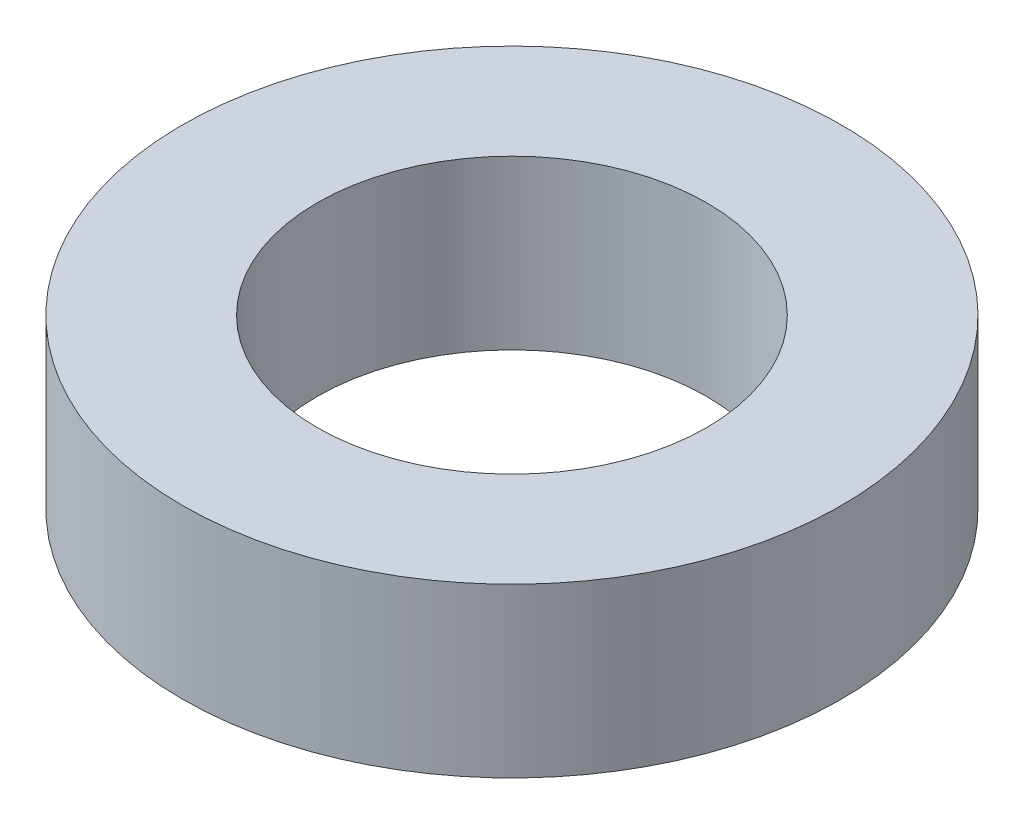
ISO-10303-21;
HEADER;
FILE_DESCRIPTION(('STEP AP214'),'2;1');
FILE_NAME('part.step','',(''),(''),'','','');
FILE_SCHEMA(('AUTOMOTIVE_DESIGN { 1 0 10303 214 1 1 1 1 }'));
ENDSEC;
DATA;
#1=APPLICATION_CONTEXT('core data for automotive mechanical design processes');
#2=APPLICATION_PROTOCOL_DEFINITION('international standard','automotive_design',2000,#1);
#3=PRODUCT_CONTEXT('',#1,'mechanical');
#4=PRODUCT('Part','Part','',(#3));
#5=PRODUCT_RELATED_PRODUCT_CATEGORY('part','',(#4));
#6=PRODUCT_DEFINITION_FORMATION('','',#4);
#7=PRODUCT_DEFINITION_CONTEXT('part definition',#1,'design');
#8=PRODUCT_DEFINITION('design','',#6,#7);
#9=PRODUCT_DEFINITION_SHAPE('','',#8);
#10=(LENGTH_UNIT() NAMED_UNIT(*) SI_UNIT(.MILLI.,.METRE.));
#11=(NAMED_UNIT(*) PLANE_ANGLE_UNIT() SI_UNIT($,.RADIAN.));
#12=(NAMED_UNIT(*) SI_UNIT($,.STERADIAN.) SOLID_ANGLE_UNIT());
#13=UNCERTAINTY_MEASURE_WITH_UNIT(LENGTH_MEASURE(1.E-05),#10,'distance_accuracy_value','');
#14=(GEOMETRIC_REPRESENTATION_CONTEXT(3) GLOBAL_UNCERTAINTY_ASSIGNED_CONTEXT((#13)) GLOBAL_UNIT_ASSIGNED_CONTEXT((#10,
#11,#12)) REPRESENTATION_CONTEXT('',''));
#15=CARTESIAN_POINT('',(0.,0.,0.));
#16=DIRECTION('',(0.,0.,1.));
#17=DIRECTION('',(1.,0.,0.));
#18=AXIS2_PLACEMENT_3D('',#15,#16,#17);
#19=CARTESIAN_POINT('',(0.,28.,0.));
#20=DIRECTION('',(0.,-1.,0.));
#21=DIRECTION('',(0.,0.,-1.));
#22=AXIS2_PLACEMENT_3D('',#19,#20,#21);
#23=CYLINDRICAL_SURFACE('',#22,55.);
#24=CARTESIAN_POINT('',(0.,28.,0.));
#25=DIRECTION('',(0.,1.,0.));
#26=DIRECTION('',(0.,0.,1.));
#27=AXIS2_PLACEMENT_3D('',#24,#25,#26);
#28=CIRCLE('',#27,55.);
#29=CARTESIAN_POINT('',(0.,28.,55.));
#30=VERTEX_POINT('',#29);
#31=EDGE_CURVE('E10',#30,#30,#28,.T.);
#32=ORIENTED_EDGE('',*,*,#31,.F.);
#33=EDGE_LOOP('',(#32));
#34=FACE_BOUND('',#33,.T.);
#35=CARTESIAN_POINT('',(0.,0.,0.));
#36=DIRECTION('',(0.,1.,0.));
#37=DIRECTION('',(0.,0.,1.));
#38=AXIS2_PLACEMENT_3D('',#35,#36,#37);
#39=CIRCLE('',#38,55.);
#40=CARTESIAN_POINT('',(0.,0.,55.));
#41=VERTEX_POINT('',#40);
#42=EDGE_CURVE('E37',#41,#41,#39,.T.);
#43=ORIENTED_EDGE('',*,*,#42,.T.);
#44=EDGE_LOOP('',(#43));
#45=FACE_BOUND('',#44,.T.);
#46=ADVANCED_FACE('F40',(#34,#45),#23,.T.);
#47=CARTESIAN_POINT('',(0.,28.,0.));
#48=DIRECTION('',(0.,1.,0.));
#49=DIRECTION('',(0.,0.,1.));
#50=AXIS2_PLACEMENT_3D('',#47,#48,#49);
#51=PLANE('',#50);
#52=CARTESIAN_POINT('',(0.,28.,0.));
#53=DIRECTION('',(0.,1.,0.));
#54=DIRECTION('',(0.,0.,1.));
#55=AXIS2_PLACEMENT_3D('',#52,#53,#54);
#56=CIRCLE('',#55,32.5);
#57=CARTESIAN_POINT('',(0.,28.,32.5));
#58=VERTEX_POINT('',#57);
#59=EDGE_CURVE('E50',#58,#58,#56,.T.);
#60=ORIENTED_EDGE('',*,*,#59,.F.);
#61=EDGE_LOOP('',(#60));
#62=FACE_BOUND('',#61,.T.);
#63=ORIENTED_EDGE('',*,*,#31,.T.);
#64=EDGE_LOOP('',(#63));
#65=FACE_BOUND('',#64,.T.);
#66=ADVANCED_FACE('F59',(#62,#65),#51,.T.);
#67=CARTESIAN_POINT('',(0.,0.,0.));
#68=DIRECTION('',(0.,1.,0.));
#69=DIRECTION('',(0.,0.,1.));
#70=AXIS2_PLACEMENT_3D('',#67,#68,#69);
#71=PLANE('',#70);
#72=CARTESIAN_POINT('',(0.,0.,0.));
#73=DIRECTION('',(0.,1.,0.));
#74=DIRECTION('',(0.,0.,1.));
#75=AXIS2_PLACEMENT_3D('',#72,#73,#74);
#76=CIRCLE('',#75,32.5);
#77=CARTESIAN_POINT('',(0.,0.,32.5));
#78=VERTEX_POINT('',#77);
#79=EDGE_CURVE('E47',#78,#78,#76,.T.);
#80=ORIENTED_EDGE('',*,*,#79,.T.);
#81=EDGE_LOOP('',(#80));
#82=FACE_BOUND('',#81,.T.);
#83=ORIENTED_EDGE('',*,*,#42,.F.);
#84=EDGE_LOOP('',(#83));
#85=FACE_BOUND('',#84,.T.);
#86=ADVANCED_FACE('F58',(#82,#85),#71,.F.);
#87=CARTESIAN_POINT('',(0.,28.,0.));
#88=DIRECTION('',(0.,-1.,0.));
#89=DIRECTION('',(0.,0.,-1.));
#90=AXIS2_PLACEMENT_3D('',#87,#88,#89);
#91=CYLINDRICAL_SURFACE('',#90,32.5);
#92=ORIENTED_EDGE('',*,*,#59,.T.);
#93=EDGE_LOOP('',(#92));
#94=FACE_BOUND('',#93,.T.);
#95=ORIENTED_EDGE('',*,*,#79,.F.);
#96=EDGE_LOOP('',(#95));
#97=FACE_BOUND('',#96,.T.);
#98=ADVANCED_FACE('F54',(#94,#97),#91,.F.);
#99=CLOSED_SHELL('',(#46,#66,#86,#98));
#100=MANIFOLD_SOLID_BREP('B2',#99);
#101=ADVANCED_BREP_SHAPE_REPRESENTATION('',(#18,#100),#14);
#102=SHAPE_DEFINITION_REPRESENTATION(#9,#101);
ENDSEC;
END-ISO-10303-21;
